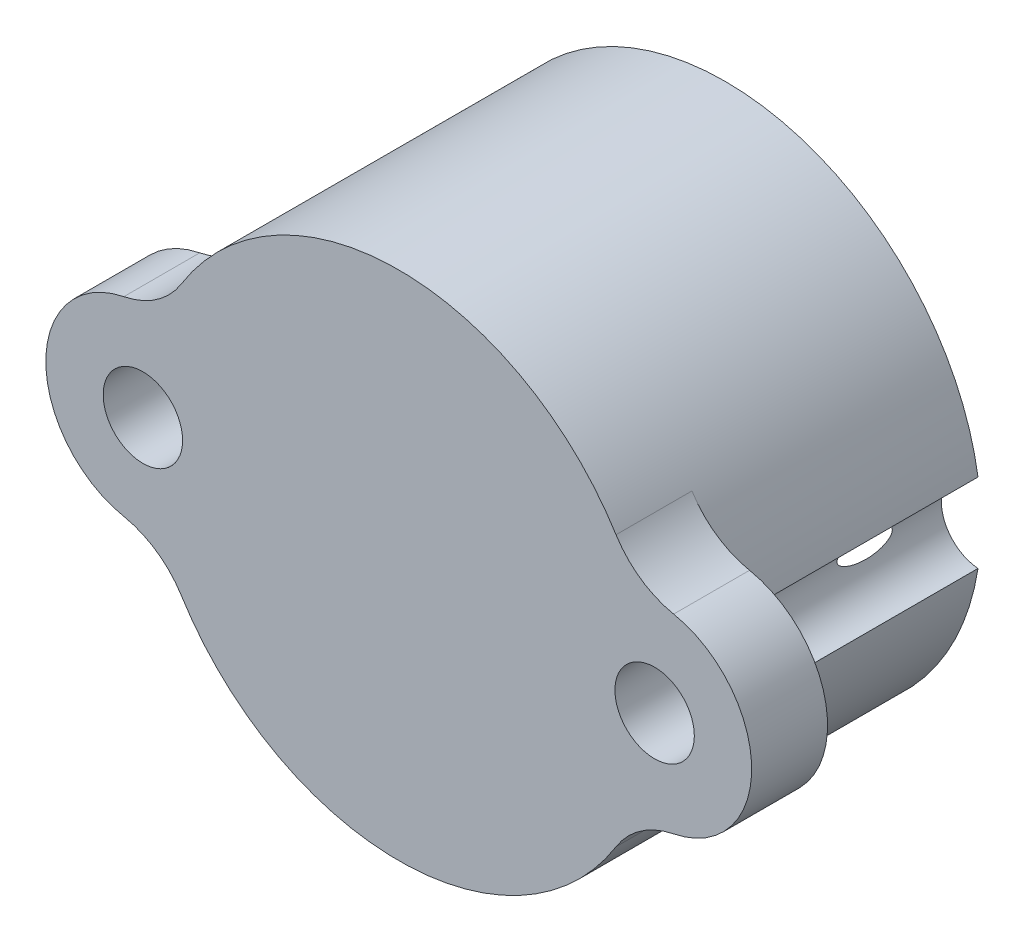
ISO-10303-21;
HEADER;
FILE_DESCRIPTION(('STEP AP214'),'2;1');
FILE_NAME('part.step','',(''),(''),'','','');
FILE_SCHEMA(('AUTOMOTIVE_DESIGN { 1 0 10303 214 1 1 1 1 }'));
ENDSEC;
DATA;
#1=APPLICATION_CONTEXT('core data for automotive mechanical design processes');
#2=APPLICATION_PROTOCOL_DEFINITION('international standard','automotive_design',2000,#1);
#3=PRODUCT_CONTEXT('',#1,'mechanical');
#4=PRODUCT('Part','Part','',(#3));
#5=PRODUCT_RELATED_PRODUCT_CATEGORY('part','',(#4));
#6=PRODUCT_DEFINITION_FORMATION('','',#4);
#7=PRODUCT_DEFINITION_CONTEXT('part definition',#1,'design');
#8=PRODUCT_DEFINITION('design','',#6,#7);
#9=PRODUCT_DEFINITION_SHAPE('','',#8);
#10=(LENGTH_UNIT() NAMED_UNIT(*) SI_UNIT(.MILLI.,.METRE.));
#11=(NAMED_UNIT(*) PLANE_ANGLE_UNIT() SI_UNIT($,.RADIAN.));
#12=(NAMED_UNIT(*) SI_UNIT($,.STERADIAN.) SOLID_ANGLE_UNIT());
#13=UNCERTAINTY_MEASURE_WITH_UNIT(LENGTH_MEASURE(1.E-05),#10,'distance_accuracy_value','');
#14=(GEOMETRIC_REPRESENTATION_CONTEXT(3) GLOBAL_UNCERTAINTY_ASSIGNED_CONTEXT((#13)) GLOBAL_UNIT_ASSIGNED_CONTEXT((#10,
#11,#12)) REPRESENTATION_CONTEXT('',''));
#15=CARTESIAN_POINT('',(0.,0.,0.));
#16=DIRECTION('',(0.,0.,1.));
#17=DIRECTION('',(1.,0.,0.));
#18=AXIS2_PLACEMENT_3D('',#15,#16,#17);
#19=CARTESIAN_POINT('',(-7.366,0.,0.));
#20=DIRECTION('',(0.,0.,1.));
#21=DIRECTION('',(1.,0.,0.));
#22=AXIS2_PLACEMENT_3D('',#19,#20,#21);
#23=CYLINDRICAL_SURFACE('',#22,1.143);
#24=CARTESIAN_POINT('',(-7.366,0.,9.398));
#25=DIRECTION('',(0.,0.,1.));
#26=DIRECTION('',(1.,0.,0.));
#27=AXIS2_PLACEMENT_3D('',#24,#25,#26);
#28=CIRCLE('',#27,1.143);
#29=CARTESIAN_POINT('',(-6.223,0.,9.398));
#30=VERTEX_POINT('',#29);
#31=EDGE_CURVE('E452',#30,#30,#28,.T.);
#32=ORIENTED_EDGE('',*,*,#31,.T.);
#33=EDGE_LOOP('',(#32));
#34=FACE_BOUND('',#33,.T.);
#35=CARTESIAN_POINT('',(-7.366,0.,0.));
#36=DIRECTION('',(0.,0.,1.));
#37=DIRECTION('',(1.,0.,0.));
#38=AXIS2_PLACEMENT_3D('',#35,#36,#37);
#39=CIRCLE('',#38,1.143);
#40=CARTESIAN_POINT('',(-7.27731896551724,-1.13955459462154,0.));
#41=VERTEX_POINT('',#40);
#42=CARTESIAN_POINT('',(-7.27731896551724,1.13955459462154,0.));
#43=VERTEX_POINT('',#42);
#44=EDGE_CURVE('E153',#41,#43,#39,.T.);
#45=ORIENTED_EDGE('',*,*,#44,.F.);
#46=DIRECTION('',(0.,0.,1.));
#47=VECTOR('',#46,1.);
#48=CARTESIAN_POINT('',(-7.27731896551724,-1.13955459462154,4.699));
#49=LINE('',#48,#47);
#50=CARTESIAN_POINT('',(-7.27731896551724,-1.13955459462154,7.2136));
#51=VERTEX_POINT('',#50);
#52=EDGE_CURVE('E66',#51,#41,#49,.F.);
#53=ORIENTED_EDGE('',*,*,#52,.F.);
#54=CARTESIAN_POINT('',(-7.366,0.,7.2136));
#55=DIRECTION('',(0.,0.,1.));
#56=DIRECTION('',(1.,0.,0.));
#57=AXIS2_PLACEMENT_3D('',#54,#55,#56);
#58=CIRCLE('',#57,1.143);
#59=CARTESIAN_POINT('',(-7.27731896551724,1.13955459462154,7.2136));
#60=VERTEX_POINT('',#59);
#61=EDGE_CURVE('E52',#60,#51,#58,.T.);
#62=ORIENTED_EDGE('',*,*,#61,.F.);
#63=DIRECTION('',(0.,0.,1.));
#64=VECTOR('',#63,1.);
#65=CARTESIAN_POINT('',(-7.27731896551724,1.13955459462154,4.699));
#66=LINE('',#65,#64);
#67=EDGE_CURVE('E219',#43,#60,#66,.T.);
#68=ORIENTED_EDGE('',*,*,#67,.F.);
#69=EDGE_LOOP('',(#45,#53,#62,#68));
#70=FACE_BOUND('',#69,.T.);
#71=CARTESIAN_POINT('',(-6.22299999667671,0.,3.00656686656911));
#72=CARTESIAN_POINT('',(-6.22300022308401,0.00854113840439753,3.00656496304866));
#73=CARTESIAN_POINT('',(-6.22309739064247,0.0170942445293236,3.00566804337497));
#74=CARTESIAN_POINT('',(-6.2234704915884,0.0338570945007122,3.00220702470581));
#75=CARTESIAN_POINT('',(-6.22374690498539,0.042065853177293,2.99963844904978));
#76=CARTESIAN_POINT('',(-6.22443571740399,0.057805020180403,2.99318784772456));
#77=CARTESIAN_POINT('',(-6.22484632200796,0.0653427943006503,2.98932313713181));
#78=CARTESIAN_POINT('',(-6.22576546470107,0.0797910081447651,2.98058911446436));
#79=CARTESIAN_POINT('',(-6.2262740150528,0.0867013691584653,2.97571967659479));
#80=CARTESIAN_POINT('',(-6.22781511439508,0.105523954284168,2.96079494743554));
#81=CARTESIAN_POINT('',(-6.22892652085305,0.116712603729425,2.94984180383498));
#82=CARTESIAN_POINT('',(-6.23124048047224,0.137395288844588,2.92644390518644));
#83=CARTESIAN_POINT('',(-6.23244336890737,0.146882616444506,2.91399355559374));
#84=CARTESIAN_POINT('',(-6.23616494735638,0.173978554588517,2.87432886175782));
#85=CARTESIAN_POINT('',(-6.23870934575976,0.189366409197521,2.84561878470594));
#86=CARTESIAN_POINT('',(-6.24357755252192,0.216326726606896,2.78649623212186));
#87=CARTESIAN_POINT('',(-6.2459007591384,0.22788898203461,2.75607945141608));
#88=CARTESIAN_POINT('',(-6.25058241423961,0.249880669760019,2.68916120019687));
#89=CARTESIAN_POINT('',(-6.25288239573668,0.259801426060839,2.65248946853826));
#90=CARTESIAN_POINT('',(-6.25696202421947,0.276687688887137,2.57842907915816));
#91=CARTESIAN_POINT('',(-6.25874104424745,0.283649639107923,2.54103961483653));
#92=CARTESIAN_POINT('',(-6.2632404180465,0.300866073946233,2.42814368806691));
#93=CARTESIAN_POINT('',(-6.26511415528667,0.307414863297735,2.35203495546075));
#94=CARTESIAN_POINT('',(-6.26658127371827,0.312630680617006,2.18817664305934));
#95=CARTESIAN_POINT('',(-6.26579367406989,0.309979291060852,2.10038074754725));
#96=CARTESIAN_POINT('',(-6.26230945073564,0.297201269522078,1.96972721365611));
#97=CARTESIAN_POINT('',(-6.26076631073974,0.291482886038891,1.92638239162202));
#98=CARTESIAN_POINT('',(-6.25695129958749,0.276627569313388,1.84033009117514));
#99=CARTESIAN_POINT('',(-6.25468026514882,0.26749455920119,1.79762193961152));
#100=CARTESIAN_POINT('',(-6.24977559412481,0.246164004699842,1.71808269188302));
#101=CARTESIAN_POINT('',(-6.24721033372765,0.234420008642109,1.6811260574621));
#102=CARTESIAN_POINT('',(-6.24167101149704,0.206277933713889,1.60891923022393));
#103=CARTESIAN_POINT('',(-6.23869737472813,0.18988467544145,1.57366731394963));
#104=CARTESIAN_POINT('',(-6.23417669898086,0.15976540784391,1.52389355260057));
#105=CARTESIAN_POINT('',(-6.23265297469159,0.148743598905754,1.50775600559318));
#106=CARTESIAN_POINT('',(-6.22970486395261,0.124240716565058,1.47748612892237));
#107=CARTESIAN_POINT('',(-6.22827986465712,0.110777135474807,1.46334073249681));
#108=CARTESIAN_POINT('',(-6.22647540782835,0.0892954815708801,1.44581907579016));
#109=CARTESIAN_POINT('',(-6.22596332372072,0.0825537685538465,1.44090348543767));
#110=CARTESIAN_POINT('',(-6.22502989662223,0.0684564006670779,1.43201312233724));
#111=CARTESIAN_POINT('',(-6.2246085634813,0.0611006792741993,1.42803845171021));
#112=CARTESIAN_POINT('',(-6.22388913821674,0.0457321645405364,1.42128848793834));
#113=CARTESIAN_POINT('',(-6.22359258840645,0.0377125356574634,1.4185281863684));
#114=CARTESIAN_POINT('',(-6.22316899766527,0.021290797262867,1.41459446047883));
#115=CARTESIAN_POINT('',(-6.22304163958676,0.0128894339810443,1.41341806708864));
#116=CARTESIAN_POINT('',(-6.22297928663091,-0.00306779867115475,1.41284166504376));
#117=CARTESIAN_POINT('',(-6.22302508019657,-0.0106174453655507,1.41326425006849));
#118=CARTESIAN_POINT('',(-6.22326056367545,-0.0255195498904053,1.41544494557921));
#119=CARTESIAN_POINT('',(-6.22345037109578,-0.0328718416156155,1.41720414666941));
#120=CARTESIAN_POINT('',(-6.22400246362474,-0.0486288568910219,1.4223504110737));
#121=CARTESIAN_POINT('',(-6.22439177081736,-0.0569476338756689,1.4259938163939));
#122=CARTESIAN_POINT('',(-6.22529820709035,-0.0728867379961656,1.43455895814869));
#123=CARTESIAN_POINT('',(-6.22581557700447,-0.0805057116429136,1.43948310403023));
#124=CARTESIAN_POINT('',(-6.22727564885445,-0.0994694743540815,1.45354433491138));
#125=CARTESIAN_POINT('',(-6.22828541229804,-0.110255302229774,1.46342010422908));
#126=CARTESIAN_POINT('',(-6.23040335672809,-0.1302692218377,1.48462021846979));
#127=CARTESIAN_POINT('',(-6.2315118138845,-0.139492718532688,1.49594866995154));
#128=CARTESIAN_POINT('',(-6.23491823116542,-0.165588511228176,1.53169584225489));
#129=CARTESIAN_POINT('',(-6.23725982403906,-0.180495882081539,1.5575267732024));
#130=CARTESIAN_POINT('',(-6.24179178384996,-0.206827642278005,1.61086691096284));
#131=CARTESIAN_POINT('',(-6.24398175166803,-0.21824309089048,1.63838021298104));
#132=CARTESIAN_POINT('',(-6.24845651038425,-0.240191733983127,1.69903969720225));
#133=CARTESIAN_POINT('',(-6.25069574045744,-0.250256865855393,1.73235745886648));
#134=CARTESIAN_POINT('',(-6.25475524534806,-0.267696298203652,1.79972582038742));
#135=CARTESIAN_POINT('',(-6.2565750095234,-0.275067325300445,1.8337772588552));
#136=CARTESIAN_POINT('',(-6.26135529026109,-0.293917574085742,1.93684587947963));
#137=CARTESIAN_POINT('',(-6.26361745612236,-0.302051686167216,2.006520319325));
#138=CARTESIAN_POINT('',(-6.26584138668923,-0.310006586863152,2.12917773206501));
#139=CARTESIAN_POINT('',(-6.26623049147241,-0.311374177048702,2.18207479532854));
#140=CARTESIAN_POINT('',(-6.26586849580632,-0.310101109987455,2.28781639470298));
#141=CARTESIAN_POINT('',(-6.26511779871686,-0.307461870701167,2.34066094277669));
#142=CARTESIAN_POINT('',(-6.26250455267668,-0.297943113933057,2.44558448135309));
#143=CARTESIAN_POINT('',(-6.26064940944644,-0.291091829869536,2.49766622468604));
#144=CARTESIAN_POINT('',(-6.25589203260003,-0.272414464957267,2.60084229938382));
#145=CARTESIAN_POINT('',(-6.25299213112302,-0.260599454598524,2.65193856501684));
#146=CARTESIAN_POINT('',(-6.2483106591492,-0.239281836319227,2.72201745087902));
#147=CARTESIAN_POINT('',(-6.24690015204811,-0.232635629522653,2.74189711886327));
#148=CARTESIAN_POINT('',(-6.24395521264304,-0.217993628415357,2.78121150800455));
#149=CARTESIAN_POINT('',(-6.2424204768858,-0.20999447400927,2.80064498109629));
#150=CARTESIAN_POINT('',(-6.23903211527194,-0.191047073699657,2.84156803185768));
#151=CARTESIAN_POINT('',(-6.23716488120863,-0.179837702331115,2.86293704381682));
#152=CARTESIAN_POINT('',(-6.23341969357164,-0.154521755566044,2.90387857447836));
#153=CARTESIAN_POINT('',(-6.23154183722226,-0.140429631758248,2.92345937561841));
#154=CARTESIAN_POINT('',(-6.22905348227471,-0.117663632088866,2.94852381302916));
#155=CARTESIAN_POINT('',(-6.22834753896103,-0.110682066384257,2.95552185367458));
#156=CARTESIAN_POINT('',(-6.22700668914755,-0.0959093922164624,2.96865010630186));
#157=CARTESIAN_POINT('',(-6.22637186275096,-0.0881173895794148,2.97477934171725));
#158=CARTESIAN_POINT('',(-6.22521067105746,-0.0715453654930485,2.98588068123091));
#159=CARTESIAN_POINT('',(-6.22468613438327,-0.0627519311664501,2.99083343024559));
#160=CARTESIAN_POINT('',(-6.22382483058762,-0.044364083627468,2.99891519101956));
#161=CARTESIAN_POINT('',(-6.22348715746092,-0.0347737991949604,3.0020530058732));
#162=CARTESIAN_POINT('',(-6.22318281039768,-0.0208555379263546,3.00487538908135));
#163=CARTESIAN_POINT('',(-6.22311458642463,-0.0167116112134069,3.00550695239828));
#164=CARTESIAN_POINT('',(-6.22302311679166,-0.0083794260998581,3.00635322511673));
#165=CARTESIAN_POINT('',(-6.22299988557819,-0.00419115389451931,3.00656780063044));
#166=CARTESIAN_POINT('',(-6.22299999667671,0.,3.00656686656911));
#167=B_SPLINE_CURVE_WITH_KNOTS('',3,(#71,#72,#73,#74,#75,#76,#77,#78,#79,#80,#81,#82,#83,#84,
#85,#86,#87,#88,#89,#90,#91,#92,#93,#94,#95,#96,#97,#98,#99,#100,#101,#102,#103,#104,#105,#106,
#107,#108,#109,#110,#111,#112,#113,#114,#115,#116,#117,#118,#119,#120,#121,#122,#123,#124,#125,
#126,#127,#128,#129,#130,#131,#132,#133,#134,#135,#136,#137,#138,#139,#140,#141,#142,#143,#144,
#145,#146,#147,#148,#149,#150,#151,#152,#153,#154,#155,#156,#157,#158,#159,#160,#161,#162,#163,
#164,#165,#166),.UNSPECIFIED.,.T.,.F.,(4,2,2,2,2,2,2,2,2,2,2,2,2,2,2,2,2,2,2,2,2,2,2,2,2,2,2,2,
2,2,2,2,2,2,2,2,2,2,2,2,2,2,2,2,2,2,2,4),(0.,0.025601135098336,0.0512711132001018,
0.0766109880506028,0.101954037456792,0.148772464767285,0.195771615266369,0.293246354630806,
0.390979114979738,0.504975144290087,0.619107805021863,0.847761736690507,1.11045360287168,
1.24159776060575,1.37259170501744,1.48902327644293,1.60533456413472,1.66400551153925,
1.72227165998144,1.74729093625798,1.77231292671006,1.79763569686021,1.82291093252669,
1.84546842239889,1.86804433771815,1.89516329093806,1.92233363656938,1.96606172450585,
2.00991627016652,2.09916407251109,2.18863850862883,2.29310010976195,2.39768821472706,
2.60766935752575,2.76628815621027,2.92485083501937,3.08236208152276,3.23952388356425,
3.30251534493054,3.36566560895875,3.43814840082655,3.5102763608157,3.53995448396791,
3.56966570620202,3.59983628323838,3.62985926752443,3.64241776465314,3.65498029343927),.UNSPECIFIED.);
#168=CARTESIAN_POINT('',(-6.22299999667671,0.,3.00656686656911));
#169=VERTEX_POINT('',#168);
#170=EDGE_CURVE('E281',#169,#169,#167,.T.);
#171=ORIENTED_EDGE('',*,*,#170,.F.);
#172=EDGE_LOOP('',(#171));
#173=FACE_BOUND('',#172,.T.);
#174=ADVANCED_FACE('F38',(#34,#70,#173),#23,.F.);
#175=CARTESIAN_POINT('',(7.366,0.,0.));
#176=DIRECTION('',(0.,0.,1.));
#177=DIRECTION('',(1.,0.,0.));
#178=AXIS2_PLACEMENT_3D('',#175,#176,#177);
#179=CYLINDRICAL_SURFACE('',#178,1.143);
#180=CARTESIAN_POINT('',(7.366,0.,9.398));
#181=DIRECTION('',(0.,0.,1.));
#182=DIRECTION('',(1.,0.,0.));
#183=AXIS2_PLACEMENT_3D('',#180,#181,#182);
#184=CIRCLE('',#183,1.143);
#185=CARTESIAN_POINT('',(8.509,0.,9.398));
#186=VERTEX_POINT('',#185);
#187=EDGE_CURVE('E139',#186,#186,#184,.T.);
#188=ORIENTED_EDGE('',*,*,#187,.T.);
#189=EDGE_LOOP('',(#188));
#190=FACE_BOUND('',#189,.T.);
#191=CARTESIAN_POINT('',(7.366,0.,0.));
#192=DIRECTION('',(0.,0.,1.));
#193=DIRECTION('',(1.,0.,0.));
#194=AXIS2_PLACEMENT_3D('',#191,#192,#193);
#195=CIRCLE('',#194,1.143);
#196=CARTESIAN_POINT('',(7.27731896551724,1.13955459462154,0.));
#197=VERTEX_POINT('',#196);
#198=CARTESIAN_POINT('',(7.27731896551724,-1.13955459462154,0.));
#199=VERTEX_POINT('',#198);
#200=EDGE_CURVE('E130',#197,#199,#195,.T.);
#201=ORIENTED_EDGE('',*,*,#200,.F.);
#202=DIRECTION('',(0.,0.,1.));
#203=VECTOR('',#202,1.);
#204=CARTESIAN_POINT('',(7.27731896551724,1.13955459462154,4.699));
#205=LINE('',#204,#203);
#206=CARTESIAN_POINT('',(7.27731896551724,1.13955459462154,7.2136));
#207=VERTEX_POINT('',#206);
#208=EDGE_CURVE('E59',#207,#197,#205,.F.);
#209=ORIENTED_EDGE('',*,*,#208,.F.);
#210=CARTESIAN_POINT('',(7.366,0.,7.2136));
#211=DIRECTION('',(0.,0.,1.));
#212=DIRECTION('',(1.,0.,0.));
#213=AXIS2_PLACEMENT_3D('',#210,#211,#212);
#214=CIRCLE('',#213,1.143);
#215=CARTESIAN_POINT('',(7.27731896551724,-1.13955459462153,7.2136));
#216=VERTEX_POINT('',#215);
#217=EDGE_CURVE('E11',#216,#207,#214,.T.);
#218=ORIENTED_EDGE('',*,*,#217,.F.);
#219=DIRECTION('',(0.,0.,1.));
#220=VECTOR('',#219,1.);
#221=CARTESIAN_POINT('',(7.27731896551724,-1.13955459462154,4.699));
#222=LINE('',#221,#220);
#223=EDGE_CURVE('E134',#199,#216,#222,.T.);
#224=ORIENTED_EDGE('',*,*,#223,.F.);
#225=EDGE_LOOP('',(#201,#209,#218,#224));
#226=FACE_BOUND('',#225,.T.);
#227=CARTESIAN_POINT('',(6.22299999667671,0.,3.0065668665691));
#228=CARTESIAN_POINT('',(6.22300022308401,-0.00854113840439642,3.00656496304865));
#229=CARTESIAN_POINT('',(6.22309739064247,-0.0170942445293212,3.00566804337496));
#230=CARTESIAN_POINT('',(6.2234704915884,-0.0338570945007106,3.0022070247058));
#231=CARTESIAN_POINT('',(6.22374690498539,-0.0420658531772933,2.99963844904978));
#232=CARTESIAN_POINT('',(6.22443571740399,-0.0578050201804024,2.99318784772456));
#233=CARTESIAN_POINT('',(6.22484632200796,-0.0653427943006468,2.9893231371318));
#234=CARTESIAN_POINT('',(6.22576546470108,-0.0797910081447599,2.98058911446435));
#235=CARTESIAN_POINT('',(6.2262740150528,-0.0867013691584614,2.97571967659478));
#236=CARTESIAN_POINT('',(6.22781511439508,-0.105523954284167,2.96079494743553));
#237=CARTESIAN_POINT('',(6.22892652085306,-0.116712603729425,2.94984180383497));
#238=CARTESIAN_POINT('',(6.23124048047224,-0.137395288844587,2.92644390518643));
#239=CARTESIAN_POINT('',(6.23244336890737,-0.146882616444503,2.91399355559373));
#240=CARTESIAN_POINT('',(6.23616494735638,-0.17397855458851,2.87432886175781));
#241=CARTESIAN_POINT('',(6.23870934575976,-0.189366409197517,2.84561878470593));
#242=CARTESIAN_POINT('',(6.24357755252192,-0.216326726606894,2.78649623212185));
#243=CARTESIAN_POINT('',(6.2459007591384,-0.227888982034608,2.75607945141607));
#244=CARTESIAN_POINT('',(6.25058241423961,-0.249880669760017,2.68916120019686));
#245=CARTESIAN_POINT('',(6.25288239573669,-0.259801426060836,2.65248946853825));
#246=CARTESIAN_POINT('',(6.25696202421947,-0.276687688887134,2.57842907915816));
#247=CARTESIAN_POINT('',(6.25874104424745,-0.28364963910792,2.54103961483653));
#248=CARTESIAN_POINT('',(6.2632404180465,-0.30086607394623,2.4281436880669));
#249=CARTESIAN_POINT('',(6.26511415528667,-0.307414863297729,2.35203495546074));
#250=CARTESIAN_POINT('',(6.26658127371827,-0.312630680616998,2.18817664305933));
#251=CARTESIAN_POINT('',(6.26579367406989,-0.309979291060844,2.10038074754725));
#252=CARTESIAN_POINT('',(6.26230945073564,-0.297201269522069,1.96972721365611));
#253=CARTESIAN_POINT('',(6.26076631073974,-0.291482886038882,1.92638239162201));
#254=CARTESIAN_POINT('',(6.25695129958749,-0.276627569313378,1.84033009117513));
#255=CARTESIAN_POINT('',(6.25468026514882,-0.26749455920118,1.79762193961151));
#256=CARTESIAN_POINT('',(6.24977559412481,-0.246164004699832,1.71808269188301));
#257=CARTESIAN_POINT('',(6.24721033372764,-0.234420008642099,1.6811260574621));
#258=CARTESIAN_POINT('',(6.24167101149704,-0.206277933713883,1.60891923022393));
#259=CARTESIAN_POINT('',(6.23869737472813,-0.189884675441447,1.57366731394963));
#260=CARTESIAN_POINT('',(6.23417669898086,-0.159765407843902,1.52389355260057));
#261=CARTESIAN_POINT('',(6.23265297469159,-0.148743598905742,1.50775600559318));
#262=CARTESIAN_POINT('',(6.22970486395261,-0.124240716565043,1.47748612892238));
#263=CARTESIAN_POINT('',(6.22827986465712,-0.110777135474793,1.46334073249681));
#264=CARTESIAN_POINT('',(6.22647540782835,-0.0892954815708678,1.44581907579017));
#265=CARTESIAN_POINT('',(6.22596332372072,-0.0825537685538348,1.44090348543767));
#266=CARTESIAN_POINT('',(6.22502989662223,-0.0684564006670645,1.43201312233724));
#267=CARTESIAN_POINT('',(6.2246085634813,-0.0611006792741837,1.42803845171022));
#268=CARTESIAN_POINT('',(6.22388913821674,-0.045732164540519,1.42128848793835));
#269=CARTESIAN_POINT('',(6.22359258840645,-0.0377125356574464,1.4185281863684));
#270=CARTESIAN_POINT('',(6.22316899766527,-0.02129079726285,1.41459446047884));
#271=CARTESIAN_POINT('',(6.22304163958676,-0.0128894339810269,1.41341806708865));
#272=CARTESIAN_POINT('',(6.22297928663091,0.00306779867117179,1.41284166504377));
#273=CARTESIAN_POINT('',(6.22302508019657,0.010617445365567,1.4132642500685));
#274=CARTESIAN_POINT('',(6.22326056367545,0.0255195498904203,1.41544494557922));
#275=CARTESIAN_POINT('',(6.22345037109578,0.03287184161563,1.41720414666942));
#276=CARTESIAN_POINT('',(6.22400246362475,0.0486288568910363,1.42235041107371));
#277=CARTESIAN_POINT('',(6.22439177081736,0.0569476338756838,1.42599381639391));
#278=CARTESIAN_POINT('',(6.22529820709035,0.0728867379961817,1.43455895814871));
#279=CARTESIAN_POINT('',(6.22581557700447,0.0805057116429304,1.43948310403024));
#280=CARTESIAN_POINT('',(6.22727564885445,0.0994694743540984,1.45354433491139));
#281=CARTESIAN_POINT('',(6.22828541229804,0.110255302229789,1.4634201042291));
#282=CARTESIAN_POINT('',(6.2304033567281,0.130269221837716,1.48462021846982));
#283=CARTESIAN_POINT('',(6.2315118138845,0.139492718532706,1.49594866995157));
#284=CARTESIAN_POINT('',(6.23491823116542,0.1655885112282,1.53169584225492));
#285=CARTESIAN_POINT('',(6.23725982403906,0.18049588208156,1.55752677320245));
#286=CARTESIAN_POINT('',(6.24179178384997,0.206827642278027,1.6108669109629));
#287=CARTESIAN_POINT('',(6.24398175166804,0.218243090890504,1.63838021298111));
#288=CARTESIAN_POINT('',(6.24845651038426,0.240191733983153,1.69903969720233));
#289=CARTESIAN_POINT('',(6.25069574045745,0.250256865855417,1.73235745886657));
#290=CARTESIAN_POINT('',(6.25475524534806,0.267696298203676,1.79972582038753));
#291=CARTESIAN_POINT('',(6.25657500952341,0.275067325300469,1.83377725885532));
#292=CARTESIAN_POINT('',(6.26135529026109,0.293917574085764,1.93684587947978));
#293=CARTESIAN_POINT('',(6.26361745612237,0.302051686167234,2.00652031932516));
#294=CARTESIAN_POINT('',(6.26584138668923,0.310006586863157,2.12917773206518));
#295=CARTESIAN_POINT('',(6.26623049147241,0.311374177048701,2.1820747953287));
#296=CARTESIAN_POINT('',(6.26586849580632,0.310101109987445,2.28781639470312));
#297=CARTESIAN_POINT('',(6.26511779871686,0.307461870701155,2.34066094277683));
#298=CARTESIAN_POINT('',(6.26250455267668,0.297943113933042,2.44558448135321));
#299=CARTESIAN_POINT('',(6.26064940944643,0.291091829869519,2.49766622468615));
#300=CARTESIAN_POINT('',(6.25589203260002,0.272414464957243,2.60084229938391));
#301=CARTESIAN_POINT('',(6.25299213112302,0.260599454598496,2.65193856501693));
#302=CARTESIAN_POINT('',(6.24831065914919,0.2392818363192,2.7220174508791));
#303=CARTESIAN_POINT('',(6.24690015204811,0.232635629522627,2.74189711886334));
#304=CARTESIAN_POINT('',(6.24395521264303,0.217993628415331,2.78121150800461));
#305=CARTESIAN_POINT('',(6.2424204768858,0.209994474009243,2.80064498109635));
#306=CARTESIAN_POINT('',(6.23903211527194,0.191047073699632,2.84156803185773));
#307=CARTESIAN_POINT('',(6.23716488120863,0.179837702331093,2.86293704381686));
#308=CARTESIAN_POINT('',(6.23341969357164,0.15452175556602,2.90387857447839));
#309=CARTESIAN_POINT('',(6.23154183722226,0.140429631758218,2.92345937561843));
#310=CARTESIAN_POINT('',(6.22905348227471,0.117663632088842,2.94852381302919));
#311=CARTESIAN_POINT('',(6.22834753896103,0.110682066384236,2.9555218536746));
#312=CARTESIAN_POINT('',(6.22700668914755,0.0959093922164409,2.96865010630188));
#313=CARTESIAN_POINT('',(6.22637186275096,0.0881173895793905,2.97477934171726));
#314=CARTESIAN_POINT('',(6.22521067105746,0.0715453654930226,2.98588068123092));
#315=CARTESIAN_POINT('',(6.22468613438327,0.0627519311664253,2.9908334302456));
#316=CARTESIAN_POINT('',(6.22382483058762,0.0443640836274427,2.99891519101956));
#317=CARTESIAN_POINT('',(6.22348715746092,0.0347737991949334,3.00205300587319));
#318=CARTESIAN_POINT('',(6.22318281039768,0.0208555379263323,3.00487538908134));
#319=CARTESIAN_POINT('',(6.22311458642463,0.0167116112133893,3.00550695239827));
#320=CARTESIAN_POINT('',(6.22302311679166,0.0083794260998496,3.00635322511672));
#321=CARTESIAN_POINT('',(6.22299988557819,0.00419115389451528,3.00656780063044));
#322=CARTESIAN_POINT('',(6.22299999667671,0.,3.0065668665691));
#323=B_SPLINE_CURVE_WITH_KNOTS('',3,(#227,#228,#229,#230,#231,#232,#233,#234,#235,#236,#237,
#238,#239,#240,#241,#242,#243,#244,#245,#246,#247,#248,#249,#250,#251,#252,#253,#254,#255,#256,
#257,#258,#259,#260,#261,#262,#263,#264,#265,#266,#267,#268,#269,#270,#271,#272,#273,#274,#275,
#276,#277,#278,#279,#280,#281,#282,#283,#284,#285,#286,#287,#288,#289,#290,#291,#292,#293,#294,
#295,#296,#297,#298,#299,#300,#301,#302,#303,#304,#305,#306,#307,#308,#309,#310,#311,#312,#313,
#314,#315,#316,#317,#318,#319,#320,#321,#322),.UNSPECIFIED.,.T.,.F.,(4,2,2,2,2,2,2,2,2,2,2,2,2,
2,2,2,2,2,2,2,2,2,2,2,2,2,2,2,2,2,2,2,2,2,2,2,2,2,2,2,2,2,2,2,2,2,2,4),(0.,0.025601135098335,
0.0512711132001005,0.076610988050602,0.101954037456791,0.148772464767285,0.195771615266369,
0.293246354630803,0.390979114979734,0.504975144290083,0.61910780502186,0.847761736690505,
1.11045360287168,1.24159776060575,1.37259170501744,1.48902327644292,1.60533456413471,
1.66400551153924,1.72227165998144,1.74729093625798,1.77231292671005,1.7976356968602,
1.82291093252668,1.84546842239888,1.86804433771814,1.89516329093805,1.92233363656937,
1.96606172450585,2.00991627016653,2.09916407251112,2.18863850862888,2.29310010976203,
2.39768821472716,2.6076693575259,2.76628815621039,2.92485083501947,3.08236208152284,
3.2395238835643,3.30251534493058,3.36566560895878,3.43814840082656,3.5102763608157,
3.5399544839679,3.56966570620202,3.59983628323837,3.62985926752441,3.64241776465312,
3.65498029343923),.UNSPECIFIED.);
#324=CARTESIAN_POINT('',(6.22299999667671,0.,3.0065668665691));
#325=VERTEX_POINT('',#324);
#326=EDGE_CURVE('E42',#325,#325,#323,.T.);
#327=ORIENTED_EDGE('',*,*,#326,.F.);
#328=EDGE_LOOP('',(#327));
#329=FACE_BOUND('',#328,.T.);
#330=ADVANCED_FACE('F131',(#190,#226,#329),#179,.F.);
#331=CARTESIAN_POINT('',(0.,0.,9.398));
#332=DIRECTION('',(0.,0.,-1.));
#333=DIRECTION('',(-1.,0.,0.));
#334=AXIS2_PLACEMENT_3D('',#331,#332,#333);
#335=CYLINDRICAL_SURFACE('',#334,7.366);
#336=CARTESIAN_POINT('',(0.,0.,0.));
#337=DIRECTION('',(0.,0.,1.));
#338=DIRECTION('',(1.,0.,0.));
#339=AXIS2_PLACEMENT_3D('',#336,#337,#338);
#340=CIRCLE('',#339,7.366);
#341=EDGE_CURVE('E154',#41,#199,#340,.T.);
#342=ORIENTED_EDGE('',*,*,#341,.T.);
#343=ORIENTED_EDGE('',*,*,#223,.T.);
#344=CARTESIAN_POINT('',(0.,0.,7.2136));
#345=DIRECTION('',(0.,0.,1.));
#346=DIRECTION('',(1.,0.,0.));
#347=AXIS2_PLACEMENT_3D('',#344,#345,#346);
#348=CIRCLE('',#347,7.366);
#349=CARTESIAN_POINT('',(6.2555641025641,-3.88919962957822,7.2136));
#350=VERTEX_POINT('',#349);
#351=EDGE_CURVE('E159',#350,#216,#348,.T.);
#352=ORIENTED_EDGE('',*,*,#351,.F.);
#353=DIRECTION('',(0.,0.,-1.));
#354=VECTOR('',#353,1.);
#355=CARTESIAN_POINT('',(6.25556410256411,-3.88919962957822,9.398));
#356=LINE('',#355,#354);
#357=CARTESIAN_POINT('',(6.2555641025641,-3.88919962957822,9.398));
#358=VERTEX_POINT('',#357);
#359=EDGE_CURVE('E176',#350,#358,#356,.F.);
#360=ORIENTED_EDGE('',*,*,#359,.T.);
#361=CARTESIAN_POINT('',(0.,0.,9.398));
#362=DIRECTION('',(0.,0.,1.));
#363=DIRECTION('',(1.,0.,0.));
#364=AXIS2_PLACEMENT_3D('',#361,#362,#363);
#365=CIRCLE('',#364,7.366);
#366=CARTESIAN_POINT('',(-6.2555641025641,-3.88919962957822,9.398));
#367=VERTEX_POINT('',#366);
#368=EDGE_CURVE('E157',#367,#358,#365,.T.);
#369=ORIENTED_EDGE('',*,*,#368,.F.);
#370=DIRECTION('',(0.,0.,-1.));
#371=VECTOR('',#370,1.);
#372=CARTESIAN_POINT('',(-6.2555641025641,-3.88919962957822,9.398));
#373=LINE('',#372,#371);
#374=CARTESIAN_POINT('',(-6.2555641025641,-3.88919962957822,7.2136));
#375=VERTEX_POINT('',#374);
#376=EDGE_CURVE('E173',#367,#375,#373,.T.);
#377=ORIENTED_EDGE('',*,*,#376,.T.);
#378=CARTESIAN_POINT('',(0.,0.,7.2136));
#379=DIRECTION('',(0.,0.,1.));
#380=DIRECTION('',(1.,0.,0.));
#381=AXIS2_PLACEMENT_3D('',#378,#379,#380);
#382=CIRCLE('',#381,7.366);
#383=EDGE_CURVE('E208',#51,#375,#382,.T.);
#384=ORIENTED_EDGE('',*,*,#383,.F.);
#385=ORIENTED_EDGE('',*,*,#52,.T.);
#386=EDGE_LOOP('',(#342,#343,#352,#360,#369,#377,#384,#385));
#387=FACE_BOUND('',#386,.T.);
#388=ADVANCED_FACE('F211',(#387),#335,.T.);
#389=CARTESIAN_POINT('',(6.2555641025641,3.88919962957822,7.2136));
#390=VERTEX_POINT('',#389);
#391=EDGE_CURVE('E149',#207,#390,#348,.T.);
#392=ORIENTED_EDGE('',*,*,#391,.F.);
#393=ORIENTED_EDGE('',*,*,#208,.T.);
#394=EDGE_CURVE('E146',#197,#43,#340,.T.);
#395=ORIENTED_EDGE('',*,*,#394,.T.);
#396=ORIENTED_EDGE('',*,*,#67,.T.);
#397=CARTESIAN_POINT('',(-6.2555641025641,3.88919962957822,7.2136));
#398=VERTEX_POINT('',#397);
#399=EDGE_CURVE('E209',#398,#60,#382,.T.);
#400=ORIENTED_EDGE('',*,*,#399,.F.);
#401=DIRECTION('',(0.,0.,-1.));
#402=VECTOR('',#401,1.);
#403=CARTESIAN_POINT('',(-6.2555641025641,3.88919962957822,9.398));
#404=LINE('',#403,#402);
#405=CARTESIAN_POINT('',(-6.2555641025641,3.88919962957822,9.398));
#406=VERTEX_POINT('',#405);
#407=EDGE_CURVE('E170',#398,#406,#404,.F.);
#408=ORIENTED_EDGE('',*,*,#407,.T.);
#409=CARTESIAN_POINT('',(6.2555641025641,3.88919962957822,9.398));
#410=VERTEX_POINT('',#409);
#411=EDGE_CURVE('E163',#410,#406,#365,.T.);
#412=ORIENTED_EDGE('',*,*,#411,.F.);
#413=DIRECTION('',(0.,0.,-1.));
#414=VECTOR('',#413,1.);
#415=CARTESIAN_POINT('',(6.2555641025641,3.88919962957822,9.398));
#416=LINE('',#415,#414);
#417=EDGE_CURVE('E179',#410,#390,#416,.T.);
#418=ORIENTED_EDGE('',*,*,#417,.T.);
#419=EDGE_LOOP('',(#392,#393,#395,#396,#400,#408,#412,#418));
#420=FACE_BOUND('',#419,.T.);
#421=ADVANCED_FACE('F144',(#420),#335,.T.);
#422=CARTESIAN_POINT('',(0.,0.,9.398));
#423=DIRECTION('',(0.,0.,1.));
#424=DIRECTION('',(1.,0.,0.));
#425=AXIS2_PLACEMENT_3D('',#422,#423,#424);
#426=PLANE('',#425);
#427=ORIENTED_EDGE('',*,*,#187,.F.);
#428=EDGE_LOOP('',(#427));
#429=FACE_BOUND('',#428,.T.);
#430=ORIENTED_EDGE('',*,*,#31,.F.);
#431=EDGE_LOOP('',(#430));
#432=FACE_BOUND('',#431,.T.);
#433=CARTESIAN_POINT('',(7.366,0.,9.398));
#434=DIRECTION('',(0.,0.,1.));
#435=DIRECTION('',(1.,0.,0.));
#436=AXIS2_PLACEMENT_3D('',#433,#434,#435);
#437=CIRCLE('',#436,2.794);
#438=CARTESIAN_POINT('',(7.91424794745484,-2.73968249768318,9.398));
#439=VERTEX_POINT('',#438);
#440=CARTESIAN_POINT('',(7.91424794745484,2.73968249768318,9.398));
#441=VERTEX_POINT('',#440);
#442=EDGE_CURVE('E225',#439,#441,#437,.T.);
#443=ORIENTED_EDGE('',*,*,#442,.T.);
#444=CARTESIAN_POINT('',(8.41265517241379,5.23030295012244,9.398));
#445=DIRECTION('',(0.,0.,1.));
#446=DIRECTION('',(1.,0.,0.));
#447=AXIS2_PLACEMENT_3D('',#444,#445,#446);
#448=CIRCLE('',#447,2.54);
#449=EDGE_CURVE('E186',#441,#410,#448,.F.);
#450=ORIENTED_EDGE('',*,*,#449,.T.);
#451=ORIENTED_EDGE('',*,*,#411,.T.);
#452=CARTESIAN_POINT('',(-8.41265517241379,5.23030295012243,9.398));
#453=DIRECTION('',(0.,0.,1.));
#454=DIRECTION('',(1.,0.,0.));
#455=AXIS2_PLACEMENT_3D('',#452,#453,#454);
#456=CIRCLE('',#455,2.54);
#457=CARTESIAN_POINT('',(-7.91424794745484,2.73968249768318,9.398));
#458=VERTEX_POINT('',#457);
#459=EDGE_CURVE('E199',#406,#458,#456,.F.);
#460=ORIENTED_EDGE('',*,*,#459,.T.);
#461=CARTESIAN_POINT('',(-7.366,0.,9.398));
#462=DIRECTION('',(0.,0.,1.));
#463=DIRECTION('',(1.,0.,0.));
#464=AXIS2_PLACEMENT_3D('',#461,#462,#463);
#465=CIRCLE('',#464,2.794);
#466=CARTESIAN_POINT('',(-7.91424794745484,-2.73968249768318,9.398));
#467=VERTEX_POINT('',#466);
#468=EDGE_CURVE('E215',#458,#467,#465,.T.);
#469=ORIENTED_EDGE('',*,*,#468,.T.);
#470=CARTESIAN_POINT('',(-8.41265517241379,-5.23030295012243,9.398));
#471=DIRECTION('',(0.,0.,1.));
#472=DIRECTION('',(1.,0.,0.));
#473=AXIS2_PLACEMENT_3D('',#470,#471,#472);
#474=CIRCLE('',#473,2.54);
#475=EDGE_CURVE('E195',#467,#367,#474,.F.);
#476=ORIENTED_EDGE('',*,*,#475,.T.);
#477=ORIENTED_EDGE('',*,*,#368,.T.);
#478=CARTESIAN_POINT('',(8.41265517241379,-5.23030295012243,9.398));
#479=DIRECTION('',(0.,0.,1.));
#480=DIRECTION('',(1.,0.,0.));
#481=AXIS2_PLACEMENT_3D('',#478,#479,#480);
#482=CIRCLE('',#481,2.54);
#483=EDGE_CURVE('E190',#358,#439,#482,.F.);
#484=ORIENTED_EDGE('',*,*,#483,.T.);
#485=EDGE_LOOP('',(#443,#450,#451,#460,#469,#476,#477,#484));
#486=FACE_BOUND('',#485,.T.);
#487=ADVANCED_FACE('F249',(#429,#432,#486),#426,.T.);
#488=CARTESIAN_POINT('',(0.,0.,0.));
#489=DIRECTION('',(0.,0.,1.));
#490=DIRECTION('',(1.,0.,0.));
#491=AXIS2_PLACEMENT_3D('',#488,#489,#490);
#492=PLANE('',#491);
#493=CARTESIAN_POINT('',(0.,0.,0.));
#494=DIRECTION('',(0.,0.,1.));
#495=DIRECTION('',(1.,0.,0.));
#496=AXIS2_PLACEMENT_3D('',#493,#494,#495);
#497=CIRCLE('',#496,5.87174168369148);
#498=CARTESIAN_POINT('',(5.87174168369148,0.,0.));
#499=VERTEX_POINT('',#498);
#500=EDGE_CURVE('E140',#499,#499,#497,.F.);
#501=ORIENTED_EDGE('',*,*,#500,.F.);
#502=EDGE_LOOP('',(#501));
#503=FACE_BOUND('',#502,.T.);
#504=ORIENTED_EDGE('',*,*,#394,.F.);
#505=ORIENTED_EDGE('',*,*,#200,.T.);
#506=ORIENTED_EDGE('',*,*,#341,.F.);
#507=ORIENTED_EDGE('',*,*,#44,.T.);
#508=EDGE_LOOP('',(#504,#505,#506,#507));
#509=FACE_BOUND('',#508,.T.);
#510=ADVANCED_FACE('F152',(#503,#509),#492,.F.);
#511=CARTESIAN_POINT('',(7.366,0.,7.2136));
#512=DIRECTION('',(0.,0.,1.));
#513=DIRECTION('',(1.,0.,0.));
#514=AXIS2_PLACEMENT_3D('',#511,#512,#513);
#515=CYLINDRICAL_SURFACE('',#514,2.794);
#516=CARTESIAN_POINT('',(7.366,0.,7.2136));
#517=DIRECTION('',(0.,0.,1.));
#518=DIRECTION('',(1.,0.,0.));
#519=AXIS2_PLACEMENT_3D('',#516,#517,#518);
#520=CIRCLE('',#519,2.794);
#521=CARTESIAN_POINT('',(7.91424794745484,-2.73968249768318,7.2136));
#522=VERTEX_POINT('',#521);
#523=CARTESIAN_POINT('',(7.91424794745484,2.73968249768318,7.2136));
#524=VERTEX_POINT('',#523);
#525=EDGE_CURVE('E155',#522,#524,#520,.T.);
#526=ORIENTED_EDGE('',*,*,#525,.T.);
#527=DIRECTION('',(0.,0.,1.));
#528=VECTOR('',#527,1.);
#529=CARTESIAN_POINT('',(7.91424794745484,2.73968249768318,7.2136));
#530=LINE('',#529,#528);
#531=EDGE_CURVE('E167',#524,#441,#530,.T.);
#532=ORIENTED_EDGE('',*,*,#531,.T.);
#533=ORIENTED_EDGE('',*,*,#442,.F.);
#534=DIRECTION('',(0.,0.,1.));
#535=VECTOR('',#534,1.);
#536=CARTESIAN_POINT('',(7.91424794745484,-2.73968249768318,7.2136));
#537=LINE('',#536,#535);
#538=EDGE_CURVE('E165',#439,#522,#537,.F.);
#539=ORIENTED_EDGE('',*,*,#538,.T.);
#540=EDGE_LOOP('',(#526,#532,#533,#539));
#541=FACE_BOUND('',#540,.T.);
#542=ADVANCED_FACE('F242',(#541),#515,.T.);
#543=CARTESIAN_POINT('',(0.,0.,7.2136));
#544=DIRECTION('',(0.,0.,1.));
#545=DIRECTION('',(1.,0.,0.));
#546=AXIS2_PLACEMENT_3D('',#543,#544,#545);
#547=PLANE('',#546);
#548=ORIENTED_EDGE('',*,*,#351,.T.);
#549=ORIENTED_EDGE('',*,*,#217,.T.);
#550=ORIENTED_EDGE('',*,*,#391,.T.);
#551=CARTESIAN_POINT('',(8.41265517241379,5.23030295012244,7.2136));
#552=DIRECTION('',(0.,0.,1.));
#553=DIRECTION('',(1.,0.,0.));
#554=AXIS2_PLACEMENT_3D('',#551,#552,#553);
#555=CIRCLE('',#554,2.54);
#556=EDGE_CURVE('E188',#390,#524,#555,.T.);
#557=ORIENTED_EDGE('',*,*,#556,.T.);
#558=ORIENTED_EDGE('',*,*,#525,.F.);
#559=CARTESIAN_POINT('',(8.41265517241379,-5.23030295012243,7.2136));
#560=DIRECTION('',(0.,0.,1.));
#561=DIRECTION('',(1.,0.,0.));
#562=AXIS2_PLACEMENT_3D('',#559,#560,#561);
#563=CIRCLE('',#562,2.54);
#564=EDGE_CURVE('E192',#522,#350,#563,.T.);
#565=ORIENTED_EDGE('',*,*,#564,.T.);
#566=EDGE_LOOP('',(#548,#549,#550,#557,#558,#565));
#567=FACE_BOUND('',#566,.T.);
#568=ADVANCED_FACE('F232',(#567),#547,.F.);
#569=CARTESIAN_POINT('',(-7.366,0.,7.2136));
#570=DIRECTION('',(0.,0.,1.));
#571=DIRECTION('',(1.,0.,0.));
#572=AXIS2_PLACEMENT_3D('',#569,#570,#571);
#573=CYLINDRICAL_SURFACE('',#572,2.794);
#574=CARTESIAN_POINT('',(-7.366,0.,7.2136));
#575=DIRECTION('',(0.,0.,1.));
#576=DIRECTION('',(1.,0.,0.));
#577=AXIS2_PLACEMENT_3D('',#574,#575,#576);
#578=CIRCLE('',#577,2.794);
#579=CARTESIAN_POINT('',(-7.91424794745484,2.73968249768318,7.2136));
#580=VERTEX_POINT('',#579);
#581=CARTESIAN_POINT('',(-7.91424794745484,-2.73968249768318,7.2136));
#582=VERTEX_POINT('',#581);
#583=EDGE_CURVE('E217',#580,#582,#578,.T.);
#584=ORIENTED_EDGE('',*,*,#583,.T.);
#585=DIRECTION('',(0.,0.,1.));
#586=VECTOR('',#585,1.);
#587=CARTESIAN_POINT('',(-7.91424794745484,-2.73968249768318,7.2136));
#588=LINE('',#587,#586);
#589=EDGE_CURVE('E183',#582,#467,#588,.T.);
#590=ORIENTED_EDGE('',*,*,#589,.T.);
#591=ORIENTED_EDGE('',*,*,#468,.F.);
#592=DIRECTION('',(0.,0.,1.));
#593=VECTOR('',#592,1.);
#594=CARTESIAN_POINT('',(-7.91424794745484,2.73968249768318,7.2136));
#595=LINE('',#594,#593);
#596=EDGE_CURVE('E181',#458,#580,#595,.F.);
#597=ORIENTED_EDGE('',*,*,#596,.T.);
#598=EDGE_LOOP('',(#584,#590,#591,#597));
#599=FACE_BOUND('',#598,.T.);
#600=ADVANCED_FACE('F255',(#599),#573,.T.);
#601=CARTESIAN_POINT('',(0.,0.,7.2136));
#602=DIRECTION('',(0.,0.,1.));
#603=DIRECTION('',(1.,0.,0.));
#604=AXIS2_PLACEMENT_3D('',#601,#602,#603);
#605=PLANE('',#604);
#606=ORIENTED_EDGE('',*,*,#399,.T.);
#607=ORIENTED_EDGE('',*,*,#61,.T.);
#608=ORIENTED_EDGE('',*,*,#383,.T.);
#609=CARTESIAN_POINT('',(-8.41265517241379,-5.23030295012243,7.2136));
#610=DIRECTION('',(0.,0.,1.));
#611=DIRECTION('',(1.,0.,0.));
#612=AXIS2_PLACEMENT_3D('',#609,#610,#611);
#613=CIRCLE('',#612,2.54);
#614=EDGE_CURVE('E197',#375,#582,#613,.T.);
#615=ORIENTED_EDGE('',*,*,#614,.T.);
#616=ORIENTED_EDGE('',*,*,#583,.F.);
#617=CARTESIAN_POINT('',(-8.41265517241379,5.23030295012243,7.2136));
#618=DIRECTION('',(0.,0.,1.));
#619=DIRECTION('',(1.,0.,0.));
#620=AXIS2_PLACEMENT_3D('',#617,#618,#619);
#621=CIRCLE('',#620,2.54);
#622=EDGE_CURVE('E201',#580,#398,#621,.T.);
#623=ORIENTED_EDGE('',*,*,#622,.T.);
#624=EDGE_LOOP('',(#606,#607,#608,#615,#616,#623));
#625=FACE_BOUND('',#624,.T.);
#626=ADVANCED_FACE('F207',(#625),#605,.F.);
#627=CARTESIAN_POINT('',(8.41265517241379,5.23030295012244,9.398));
#628=DIRECTION('',(0.,0.,-1.));
#629=DIRECTION('',(-1.,0.,0.));
#630=AXIS2_PLACEMENT_3D('',#627,#628,#629);
#631=CYLINDRICAL_SURFACE('',#630,2.54);
#632=ORIENTED_EDGE('',*,*,#556,.F.);
#633=ORIENTED_EDGE('',*,*,#417,.F.);
#634=ORIENTED_EDGE('',*,*,#449,.F.);
#635=ORIENTED_EDGE('',*,*,#531,.F.);
#636=EDGE_LOOP('',(#632,#633,#634,#635));
#637=FACE_BOUND('',#636,.T.);
#638=ADVANCED_FACE('F240',(#637),#631,.F.);
#639=CARTESIAN_POINT('',(8.41265517241379,-5.23030295012243,7.2136));
#640=DIRECTION('',(0.,0.,-1.));
#641=DIRECTION('',(-1.,0.,0.));
#642=AXIS2_PLACEMENT_3D('',#639,#640,#641);
#643=CYLINDRICAL_SURFACE('',#642,2.54);
#644=ORIENTED_EDGE('',*,*,#564,.F.);
#645=ORIENTED_EDGE('',*,*,#538,.F.);
#646=ORIENTED_EDGE('',*,*,#483,.F.);
#647=ORIENTED_EDGE('',*,*,#359,.F.);
#648=EDGE_LOOP('',(#644,#645,#646,#647));
#649=FACE_BOUND('',#648,.T.);
#650=ADVANCED_FACE('F247',(#649),#643,.F.);
#651=CARTESIAN_POINT('',(-8.41265517241379,-5.23030295012243,9.398));
#652=DIRECTION('',(0.,0.,-1.));
#653=DIRECTION('',(-1.,0.,0.));
#654=AXIS2_PLACEMENT_3D('',#651,#652,#653);
#655=CYLINDRICAL_SURFACE('',#654,2.54);
#656=ORIENTED_EDGE('',*,*,#614,.F.);
#657=ORIENTED_EDGE('',*,*,#376,.F.);
#658=ORIENTED_EDGE('',*,*,#475,.F.);
#659=ORIENTED_EDGE('',*,*,#589,.F.);
#660=EDGE_LOOP('',(#656,#657,#658,#659));
#661=FACE_BOUND('',#660,.T.);
#662=ADVANCED_FACE('F260',(#661),#655,.F.);
#663=CARTESIAN_POINT('',(-8.41265517241379,5.23030295012243,7.2136));
#664=DIRECTION('',(0.,0.,-1.));
#665=DIRECTION('',(-1.,0.,0.));
#666=AXIS2_PLACEMENT_3D('',#663,#664,#665);
#667=CYLINDRICAL_SURFACE('',#666,2.54);
#668=ORIENTED_EDGE('',*,*,#622,.F.);
#669=ORIENTED_EDGE('',*,*,#596,.F.);
#670=ORIENTED_EDGE('',*,*,#459,.F.);
#671=ORIENTED_EDGE('',*,*,#407,.F.);
#672=EDGE_LOOP('',(#668,#669,#670,#671));
#673=FACE_BOUND('',#672,.T.);
#674=ADVANCED_FACE('F40',(#673),#667,.F.);
#675=CARTESIAN_POINT('',(0.,0.,2.2098));
#676=DIRECTION('',(0.,0.,1.));
#677=DIRECTION('',(0.,1.,0.));
#678=AXIS2_PLACEMENT_3D('',#675,#676,#677);
#679=SPHERICAL_SURFACE('',#678,6.2738);
#680=ORIENTED_EDGE('',*,*,#326,.T.);
#681=EDGE_LOOP('',(#680));
#682=FACE_BOUND('',#681,.T.);
#683=ORIENTED_EDGE('',*,*,#170,.T.);
#684=EDGE_LOOP('',(#683));
#685=FACE_BOUND('',#684,.T.);
#686=ORIENTED_EDGE('',*,*,#500,.T.);
#687=EDGE_LOOP('',(#686));
#688=FACE_BOUND('',#687,.T.);
#689=ADVANCED_FACE('F266',(#682,#685,#688),#679,.F.);
#690=CLOSED_SHELL('',(#174,#330,#388,#421,#487,#510,#542,#568,#600,#626,#638,#650,#662,#674,#689));
#691=MANIFOLD_SOLID_BREP('B2',#690);
#692=ADVANCED_BREP_SHAPE_REPRESENTATION('',(#18,#691),#14);
#693=SHAPE_DEFINITION_REPRESENTATION(#9,#692);
ENDSEC;
END-ISO-10303-21;
